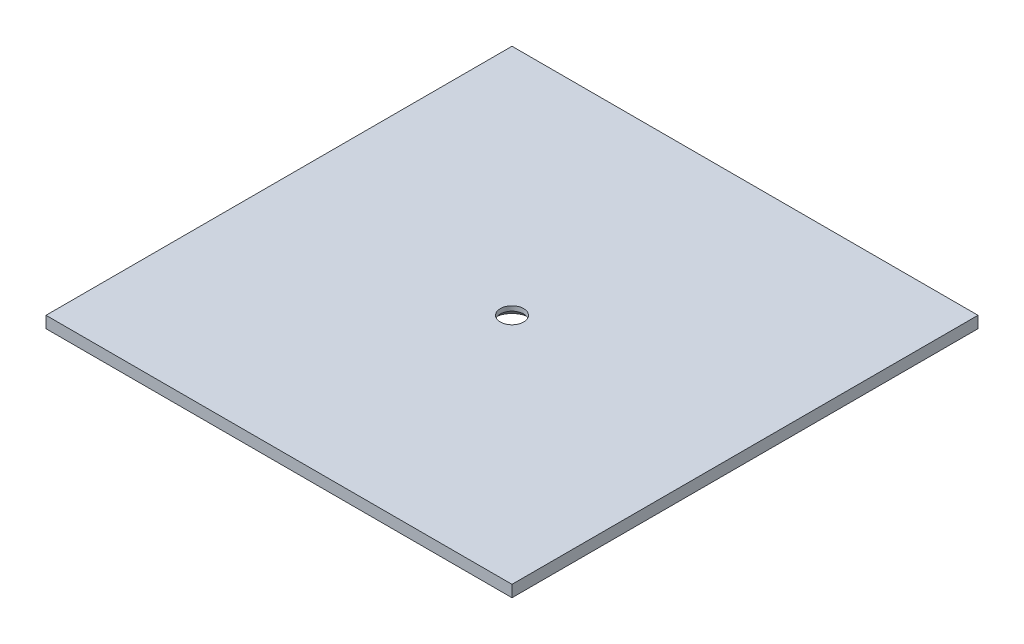
ISO-10303-21;
HEADER;
FILE_DESCRIPTION(('STEP AP214'),'2;1');
FILE_NAME('part.step','',(''),(''),'','','');
FILE_SCHEMA(('AUTOMOTIVE_DESIGN { 1 0 10303 214 1 1 1 1 }'));
ENDSEC;
DATA;
#1=APPLICATION_CONTEXT('core data for automotive mechanical design processes');
#2=APPLICATION_PROTOCOL_DEFINITION('international standard','automotive_design',2000,#1);
#3=PRODUCT_CONTEXT('',#1,'mechanical');
#4=PRODUCT('Part','Part','',(#3));
#5=PRODUCT_RELATED_PRODUCT_CATEGORY('part','',(#4));
#6=PRODUCT_DEFINITION_FORMATION('','',#4);
#7=PRODUCT_DEFINITION_CONTEXT('part definition',#1,'design');
#8=PRODUCT_DEFINITION('design','',#6,#7);
#9=PRODUCT_DEFINITION_SHAPE('','',#8);
#10=(LENGTH_UNIT() NAMED_UNIT(*) SI_UNIT(.MILLI.,.METRE.));
#11=(NAMED_UNIT(*) PLANE_ANGLE_UNIT() SI_UNIT($,.RADIAN.));
#12=(NAMED_UNIT(*) SI_UNIT($,.STERADIAN.) SOLID_ANGLE_UNIT());
#13=UNCERTAINTY_MEASURE_WITH_UNIT(LENGTH_MEASURE(1.E-05),#10,'distance_accuracy_value','');
#14=(GEOMETRIC_REPRESENTATION_CONTEXT(3) GLOBAL_UNCERTAINTY_ASSIGNED_CONTEXT((#13)) GLOBAL_UNIT_ASSIGNED_CONTEXT((#10,
#11,#12)) REPRESENTATION_CONTEXT('',''));
#15=CARTESIAN_POINT('',(0.,0.,0.));
#16=DIRECTION('',(0.,0.,1.));
#17=DIRECTION('',(1.,0.,0.));
#18=AXIS2_PLACEMENT_3D('',#15,#16,#17);
#19=CARTESIAN_POINT('',(0.,5.,0.));
#20=DIRECTION('',(0.,-1.,0.));
#21=DIRECTION('',(0.,0.,-1.));
#22=AXIS2_PLACEMENT_3D('',#19,#20,#21);
#23=PLANE('',#22);
#24=DIRECTION('',(0.,0.,-1.));
#25=VECTOR('',#24,1.);
#26=CARTESIAN_POINT('',(100.,5.,100.));
#27=LINE('',#26,#25);
#28=CARTESIAN_POINT('',(100.,5.,100.));
#29=VERTEX_POINT('',#28);
#30=CARTESIAN_POINT('',(100.,5.,-100.));
#31=VERTEX_POINT('',#30);
#32=EDGE_CURVE('E86',#29,#31,#27,.T.);
#33=ORIENTED_EDGE('',*,*,#32,.T.);
#34=DIRECTION('',(-1.,0.,0.));
#35=VECTOR('',#34,1.);
#36=CARTESIAN_POINT('',(-100.,5.,-100.));
#37=LINE('',#36,#35);
#38=CARTESIAN_POINT('',(-100.,5.,-100.));
#39=VERTEX_POINT('',#38);
#40=EDGE_CURVE('E81',#31,#39,#37,.T.);
#41=ORIENTED_EDGE('',*,*,#40,.T.);
#42=DIRECTION('',(0.,0.,1.));
#43=VECTOR('',#42,1.);
#44=CARTESIAN_POINT('',(-100.,5.,100.));
#45=LINE('',#44,#43);
#46=CARTESIAN_POINT('',(-100.,5.,100.));
#47=VERTEX_POINT('',#46);
#48=EDGE_CURVE('E84',#39,#47,#45,.T.);
#49=ORIENTED_EDGE('',*,*,#48,.T.);
#50=DIRECTION('',(1.,0.,0.));
#51=VECTOR('',#50,1.);
#52=CARTESIAN_POINT('',(-100.,5.,100.));
#53=LINE('',#52,#51);
#54=EDGE_CURVE('E50',#47,#29,#53,.T.);
#55=ORIENTED_EDGE('',*,*,#54,.T.);
#56=EDGE_LOOP('',(#33,#41,#49,#55));
#57=FACE_BOUND('',#56,.T.);
#58=CARTESIAN_POINT('',(0.,5.,0.));
#59=DIRECTION('',(0.,1.,0.));
#60=DIRECTION('',(0.,0.,1.));
#61=AXIS2_PLACEMENT_3D('',#58,#59,#60);
#62=CIRCLE('',#61,5.);
#63=CARTESIAN_POINT('',(0.,5.,4.99999999999999));
#64=VERTEX_POINT('',#63);
#65=EDGE_CURVE('E104',#64,#64,#62,.T.);
#66=ORIENTED_EDGE('',*,*,#65,.F.);
#67=EDGE_LOOP('',(#66));
#68=FACE_BOUND('',#67,.T.);
#69=ADVANCED_FACE('F33',(#57,#68),#23,.F.);
#70=CARTESIAN_POINT('',(0.,0.,0.));
#71=DIRECTION('',(0.,-1.,0.));
#72=DIRECTION('',(0.,0.,-1.));
#73=AXIS2_PLACEMENT_3D('',#70,#71,#72);
#74=PLANE('',#73);
#75=CARTESIAN_POINT('',(0.,0.,0.));
#76=DIRECTION('',(0.,-1.,0.));
#77=DIRECTION('',(0.,0.,-1.));
#78=AXIS2_PLACEMENT_3D('',#75,#76,#77);
#79=CIRCLE('',#78,7.99999999999998);
#80=CARTESIAN_POINT('',(0.,0.,-7.99999999999999));
#81=VERTEX_POINT('',#80);
#82=EDGE_CURVE('E42',#81,#81,#79,.F.);
#83=ORIENTED_EDGE('',*,*,#82,.T.);
#84=EDGE_LOOP('',(#83));
#85=FACE_BOUND('',#84,.T.);
#86=DIRECTION('',(0.,0.,-1.));
#87=VECTOR('',#86,1.);
#88=CARTESIAN_POINT('',(100.,0.,100.));
#89=LINE('',#88,#87);
#90=CARTESIAN_POINT('',(100.,0.,100.));
#91=VERTEX_POINT('',#90);
#92=CARTESIAN_POINT('',(100.,0.,-100.));
#93=VERTEX_POINT('',#92);
#94=EDGE_CURVE('E101',#91,#93,#89,.T.);
#95=ORIENTED_EDGE('',*,*,#94,.F.);
#96=DIRECTION('',(1.,0.,0.));
#97=VECTOR('',#96,1.);
#98=CARTESIAN_POINT('',(-100.,0.,100.));
#99=LINE('',#98,#97);
#100=CARTESIAN_POINT('',(-100.,0.,100.));
#101=VERTEX_POINT('',#100);
#102=EDGE_CURVE('E73',#101,#91,#99,.T.);
#103=ORIENTED_EDGE('',*,*,#102,.F.);
#104=DIRECTION('',(0.,0.,1.));
#105=VECTOR('',#104,1.);
#106=CARTESIAN_POINT('',(-100.,0.,100.));
#107=LINE('',#106,#105);
#108=CARTESIAN_POINT('',(-100.,0.,-100.));
#109=VERTEX_POINT('',#108);
#110=EDGE_CURVE('E67',#109,#101,#107,.T.);
#111=ORIENTED_EDGE('',*,*,#110,.F.);
#112=DIRECTION('',(-1.,0.,0.));
#113=VECTOR('',#112,1.);
#114=CARTESIAN_POINT('',(-100.,0.,-100.));
#115=LINE('',#114,#113);
#116=EDGE_CURVE('E91',#93,#109,#115,.T.);
#117=ORIENTED_EDGE('',*,*,#116,.F.);
#118=EDGE_LOOP('',(#95,#103,#111,#117));
#119=FACE_BOUND('',#118,.T.);
#120=ADVANCED_FACE('F113',(#85,#119),#74,.T.);
#121=CARTESIAN_POINT('',(100.,5.,100.));
#122=DIRECTION('',(-1.,0.,0.));
#123=DIRECTION('',(0.,0.,1.));
#124=AXIS2_PLACEMENT_3D('',#121,#122,#123);
#125=PLANE('',#124);
#126=ORIENTED_EDGE('',*,*,#94,.T.);
#127=DIRECTION('',(0.,-1.,0.));
#128=VECTOR('',#127,1.);
#129=CARTESIAN_POINT('',(100.,5.,-100.));
#130=LINE('',#129,#128);
#131=EDGE_CURVE('E92',#31,#93,#130,.T.);
#132=ORIENTED_EDGE('',*,*,#131,.F.);
#133=ORIENTED_EDGE('',*,*,#32,.F.);
#134=DIRECTION('',(0.,-1.,0.));
#135=VECTOR('',#134,1.);
#136=CARTESIAN_POINT('',(100.,5.,100.));
#137=LINE('',#136,#135);
#138=EDGE_CURVE('E97',#29,#91,#137,.T.);
#139=ORIENTED_EDGE('',*,*,#138,.T.);
#140=EDGE_LOOP('',(#126,#132,#133,#139));
#141=FACE_BOUND('',#140,.T.);
#142=ADVANCED_FACE('F131',(#141),#125,.F.);
#143=CARTESIAN_POINT('',(-100.,5.,-100.));
#144=DIRECTION('',(0.,0.,1.));
#145=DIRECTION('',(1.,0.,0.));
#146=AXIS2_PLACEMENT_3D('',#143,#144,#145);
#147=PLANE('',#146);
#148=ORIENTED_EDGE('',*,*,#116,.T.);
#149=DIRECTION('',(0.,-1.,0.));
#150=VECTOR('',#149,1.);
#151=CARTESIAN_POINT('',(-100.,5.,-100.));
#152=LINE('',#151,#150);
#153=EDGE_CURVE('E89',#39,#109,#152,.T.);
#154=ORIENTED_EDGE('',*,*,#153,.F.);
#155=ORIENTED_EDGE('',*,*,#40,.F.);
#156=ORIENTED_EDGE('',*,*,#131,.T.);
#157=EDGE_LOOP('',(#148,#154,#155,#156));
#158=FACE_BOUND('',#157,.T.);
#159=ADVANCED_FACE('F90',(#158),#147,.F.);
#160=CARTESIAN_POINT('',(-100.,5.,100.));
#161=DIRECTION('',(1.,0.,0.));
#162=DIRECTION('',(0.,0.,-1.));
#163=AXIS2_PLACEMENT_3D('',#160,#161,#162);
#164=PLANE('',#163);
#165=ORIENTED_EDGE('',*,*,#110,.T.);
#166=DIRECTION('',(0.,-1.,0.));
#167=VECTOR('',#166,1.);
#168=CARTESIAN_POINT('',(-100.,5.,100.));
#169=LINE('',#168,#167);
#170=EDGE_CURVE('E93',#47,#101,#169,.T.);
#171=ORIENTED_EDGE('',*,*,#170,.F.);
#172=ORIENTED_EDGE('',*,*,#48,.F.);
#173=ORIENTED_EDGE('',*,*,#153,.T.);
#174=EDGE_LOOP('',(#165,#171,#172,#173));
#175=FACE_BOUND('',#174,.T.);
#176=ADVANCED_FACE('F95',(#175),#164,.F.);
#177=CARTESIAN_POINT('',(-100.,5.,100.));
#178=DIRECTION('',(0.,0.,-1.));
#179=DIRECTION('',(-1.,0.,0.));
#180=AXIS2_PLACEMENT_3D('',#177,#178,#179);
#181=PLANE('',#180);
#182=ORIENTED_EDGE('',*,*,#102,.T.);
#183=ORIENTED_EDGE('',*,*,#138,.F.);
#184=ORIENTED_EDGE('',*,*,#54,.F.);
#185=ORIENTED_EDGE('',*,*,#170,.T.);
#186=EDGE_LOOP('',(#182,#183,#184,#185));
#187=FACE_BOUND('',#186,.T.);
#188=ADVANCED_FACE('F122',(#187),#181,.F.);
#189=CARTESIAN_POINT('',(0.,5.,0.));
#190=DIRECTION('',(0.,-1.,0.));
#191=DIRECTION('',(0.,0.,-1.));
#192=AXIS2_PLACEMENT_3D('',#189,#190,#191);
#193=CYLINDRICAL_SURFACE('',#192,5.);
#194=CARTESIAN_POINT('',(0.,2.99999999999996,0.));
#195=DIRECTION('',(0.,-1.,0.));
#196=DIRECTION('',(0.,0.,-1.));
#197=AXIS2_PLACEMENT_3D('',#194,#195,#196);
#198=CIRCLE('',#197,5.);
#199=CARTESIAN_POINT('',(0.,2.99999999999996,-5.00000000000002));
#200=VERTEX_POINT('',#199);
#201=EDGE_CURVE('E11',#200,#200,#198,.T.);
#202=ORIENTED_EDGE('',*,*,#201,.T.);
#203=EDGE_LOOP('',(#202));
#204=FACE_BOUND('',#203,.T.);
#205=ORIENTED_EDGE('',*,*,#65,.T.);
#206=EDGE_LOOP('',(#205));
#207=FACE_BOUND('',#206,.T.);
#208=ADVANCED_FACE('F117',(#204,#207),#193,.F.);
#209=CARTESIAN_POINT('',(0.,0.,0.));
#210=DIRECTION('',(0.,-1.,0.));
#211=DIRECTION('',(0.,0.,-1.));
#212=AXIS2_PLACEMENT_3D('',#209,#210,#211);
#213=CONICAL_SURFACE('',#212,7.99999999999998,0.785398163397451);
#214=ORIENTED_EDGE('',*,*,#201,.F.);
#215=EDGE_LOOP('',(#214));
#216=FACE_BOUND('',#215,.T.);
#217=ORIENTED_EDGE('',*,*,#82,.F.);
#218=EDGE_LOOP('',(#217));
#219=FACE_BOUND('',#218,.T.);
#220=ADVANCED_FACE('F35',(#216,#219),#213,.F.);
#221=CLOSED_SHELL('',(#69,#120,#142,#159,#176,#188,#208,#220));
#222=MANIFOLD_SOLID_BREP('B2',#221);
#223=ADVANCED_BREP_SHAPE_REPRESENTATION('',(#18,#222),#14);
#224=SHAPE_DEFINITION_REPRESENTATION(#9,#223);
ENDSEC;
END-ISO-10303-21;
